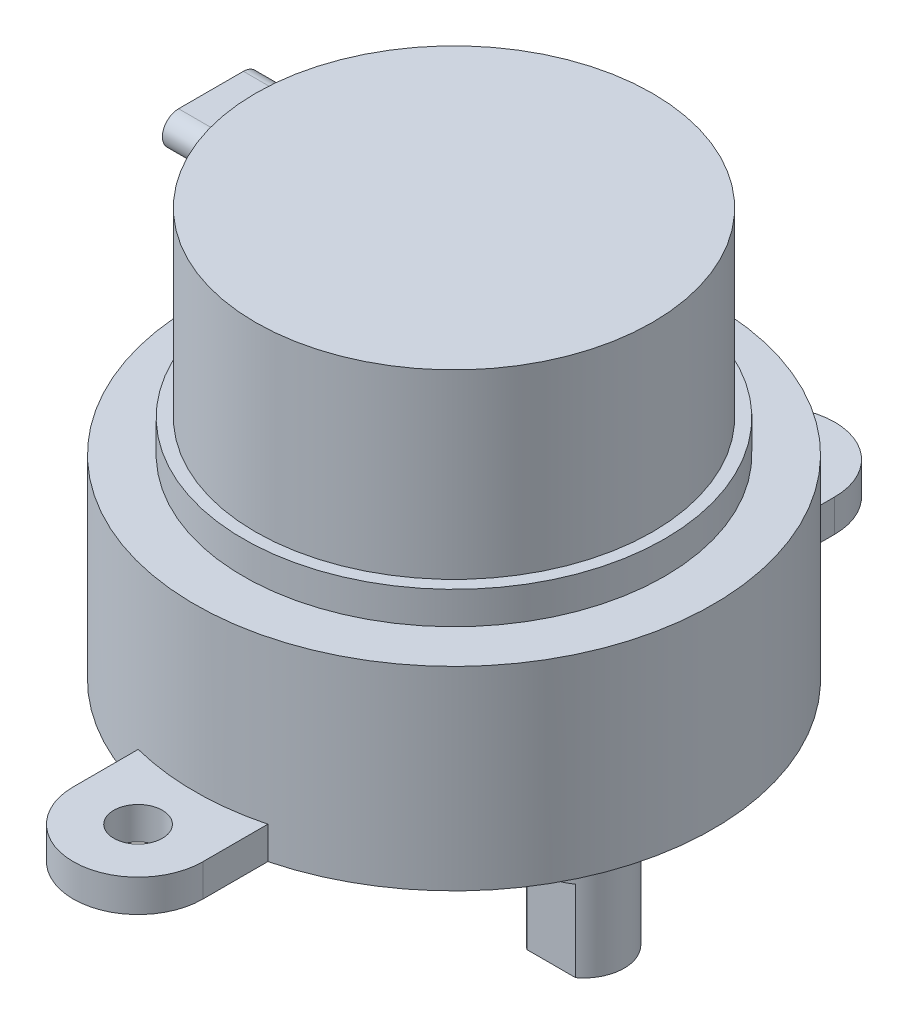
ISO-10303-21;
HEADER;
FILE_DESCRIPTION(('STEP AP214'),'2;1');
FILE_NAME('part.step','',(''),(''),'','','');
FILE_SCHEMA(('AUTOMOTIVE_DESIGN { 1 0 10303 214 1 1 1 1 }'));
ENDSEC;
DATA;
#1=APPLICATION_CONTEXT('core data for automotive mechanical design processes');
#2=APPLICATION_PROTOCOL_DEFINITION('international standard','automotive_design',2000,#1);
#3=PRODUCT_CONTEXT('',#1,'mechanical');
#4=PRODUCT('Part','Part','',(#3));
#5=PRODUCT_RELATED_PRODUCT_CATEGORY('part','',(#4));
#6=PRODUCT_DEFINITION_FORMATION('','',#4);
#7=PRODUCT_DEFINITION_CONTEXT('part definition',#1,'design');
#8=PRODUCT_DEFINITION('design','',#6,#7);
#9=PRODUCT_DEFINITION_SHAPE('','',#8);
#10=(LENGTH_UNIT() NAMED_UNIT(*) SI_UNIT(.MILLI.,.METRE.));
#11=(NAMED_UNIT(*) PLANE_ANGLE_UNIT() SI_UNIT($,.RADIAN.));
#12=(NAMED_UNIT(*) SI_UNIT($,.STERADIAN.) SOLID_ANGLE_UNIT());
#13=UNCERTAINTY_MEASURE_WITH_UNIT(LENGTH_MEASURE(1.E-05),#10,'distance_accuracy_value','');
#14=(GEOMETRIC_REPRESENTATION_CONTEXT(3) GLOBAL_UNCERTAINTY_ASSIGNED_CONTEXT((#13)) GLOBAL_UNIT_ASSIGNED_CONTEXT((#10,
#11,#12)) REPRESENTATION_CONTEXT('',''));
#15=CARTESIAN_POINT('',(0.,0.,0.));
#16=DIRECTION('',(0.,0.,1.));
#17=DIRECTION('',(1.,0.,0.));
#18=AXIS2_PLACEMENT_3D('',#15,#16,#17);
#19=CARTESIAN_POINT('',(0.,0.,0.));
#20=DIRECTION('',(0.,-1.,0.));
#21=DIRECTION('',(1.,0.,0.));
#22=AXIS2_PLACEMENT_3D('',#19,#20,#21);
#23=PLANE('',#22);
#24=CARTESIAN_POINT('',(8.,0.,0.));
#25=DIRECTION('',(0.,-1.,0.));
#26=DIRECTION('',(1.,0.,0.));
#27=AXIS2_PLACEMENT_3D('',#24,#25,#26);
#28=CIRCLE('',#27,4.5);
#29=CARTESIAN_POINT('',(12.5,0.,0.));
#30=VERTEX_POINT('',#29);
#31=EDGE_CURVE('E331',#30,#30,#28,.T.);
#32=ORIENTED_EDGE('',*,*,#31,.F.);
#33=EDGE_LOOP('',(#32));
#34=FACE_BOUND('',#33,.T.);
#35=CARTESIAN_POINT('',(0.,0.,0.));
#36=DIRECTION('',(0.,1.,0.));
#37=DIRECTION('',(-1.,0.,0.));
#38=AXIS2_PLACEMENT_3D('',#35,#36,#37);
#39=CIRCLE('',#38,16.);
#40=CARTESIAN_POINT('',(-4.,0.,-15.4919333848297));
#41=VERTEX_POINT('',#40);
#42=CARTESIAN_POINT('',(-4.00000000000001,0.,15.4919333848297));
#43=VERTEX_POINT('',#42);
#44=EDGE_CURVE('E327',#41,#43,#39,.T.);
#45=ORIENTED_EDGE('',*,*,#44,.F.);
#46=DIRECTION('',(0.,0.,-1.));
#47=VECTOR('',#46,1.);
#48=CARTESIAN_POINT('',(-4.00000000000001,0.,19.5));
#49=LINE('',#48,#47);
#50=CARTESIAN_POINT('',(-4.,0.,-19.5));
#51=VERTEX_POINT('',#50);
#52=EDGE_CURVE('E240',#41,#51,#49,.T.);
#53=ORIENTED_EDGE('',*,*,#52,.T.);
#54=CARTESIAN_POINT('',(0.,0.,-19.5));
#55=DIRECTION('',(0.,-1.,0.));
#56=DIRECTION('',(1.,0.,0.));
#57=AXIS2_PLACEMENT_3D('',#54,#55,#56);
#58=CIRCLE('',#57,4.);
#59=CARTESIAN_POINT('',(4.00000000000001,0.,-19.5));
#60=VERTEX_POINT('',#59);
#61=EDGE_CURVE('E245',#51,#60,#58,.T.);
#62=ORIENTED_EDGE('',*,*,#61,.T.);
#63=DIRECTION('',(0.,0.,1.));
#64=VECTOR('',#63,1.);
#65=CARTESIAN_POINT('',(3.99999999999999,0.,19.5));
#66=LINE('',#65,#64);
#67=CARTESIAN_POINT('',(4.,0.,-15.4919333848297));
#68=VERTEX_POINT('',#67);
#69=EDGE_CURVE('E222',#60,#68,#66,.T.);
#70=ORIENTED_EDGE('',*,*,#69,.T.);
#71=CARTESIAN_POINT('',(3.99999999999999,0.,15.4919333848297));
#72=VERTEX_POINT('',#71);
#73=EDGE_CURVE('E330',#72,#68,#39,.T.);
#74=ORIENTED_EDGE('',*,*,#73,.F.);
#75=CARTESIAN_POINT('',(3.99999999999999,0.,19.5));
#76=VERTEX_POINT('',#75);
#77=EDGE_CURVE('E249',#72,#76,#66,.T.);
#78=ORIENTED_EDGE('',*,*,#77,.T.);
#79=CARTESIAN_POINT('',(0.,0.,19.5));
#80=DIRECTION('',(0.,-1.,0.));
#81=DIRECTION('',(1.,0.,0.));
#82=AXIS2_PLACEMENT_3D('',#79,#80,#81);
#83=CIRCLE('',#82,4.);
#84=CARTESIAN_POINT('',(-4.00000000000001,0.,19.5));
#85=VERTEX_POINT('',#84);
#86=EDGE_CURVE('E213',#76,#85,#83,.T.);
#87=ORIENTED_EDGE('',*,*,#86,.T.);
#88=EDGE_CURVE('E241',#85,#43,#49,.T.);
#89=ORIENTED_EDGE('',*,*,#88,.T.);
#90=EDGE_LOOP('',(#45,#53,#62,#70,#74,#78,#87,#89));
#91=FACE_BOUND('',#90,.T.);
#92=CARTESIAN_POINT('',(0.,0.,19.5));
#93=DIRECTION('',(0.,-1.,0.));
#94=DIRECTION('',(1.,0.,0.));
#95=AXIS2_PLACEMENT_3D('',#92,#93,#94);
#96=CIRCLE('',#95,1.5);
#97=CARTESIAN_POINT('',(1.49999999999999,0.,19.5));
#98=VERTEX_POINT('',#97);
#99=EDGE_CURVE('E205',#98,#98,#96,.T.);
#100=ORIENTED_EDGE('',*,*,#99,.F.);
#101=EDGE_LOOP('',(#100));
#102=FACE_BOUND('',#101,.T.);
#103=CARTESIAN_POINT('',(0.,0.,-19.5));
#104=DIRECTION('',(0.,-1.,0.));
#105=DIRECTION('',(1.,0.,0.));
#106=AXIS2_PLACEMENT_3D('',#103,#104,#105);
#107=CIRCLE('',#106,1.5);
#108=CARTESIAN_POINT('',(1.50000000000001,0.,-19.5));
#109=VERTEX_POINT('',#108);
#110=EDGE_CURVE('E194',#109,#109,#107,.T.);
#111=ORIENTED_EDGE('',*,*,#110,.F.);
#112=EDGE_LOOP('',(#111));
#113=FACE_BOUND('',#112,.T.);
#114=ADVANCED_FACE('F41',(#34,#91,#102,#113),#23,.T.);
#115=CARTESIAN_POINT('',(0.,25.2,0.));
#116=DIRECTION('',(0.,1.,0.));
#117=DIRECTION('',(-1.,0.,0.));
#118=AXIS2_PLACEMENT_3D('',#115,#116,#117);
#119=CYLINDRICAL_SURFACE('',#118,16.);
#120=DIRECTION('',(0.,1.,0.));
#121=VECTOR('',#120,1.);
#122=CARTESIAN_POINT('',(4.00000000000001,25.2,-15.4919333848297));
#123=LINE('',#122,#121);
#124=CARTESIAN_POINT('',(4.,2.,-15.4919333848297));
#125=VERTEX_POINT('',#124);
#126=EDGE_CURVE('E373',#125,#68,#123,.F.);
#127=ORIENTED_EDGE('',*,*,#126,.F.);
#128=CARTESIAN_POINT('',(0.,2.,0.));
#129=DIRECTION('',(0.,-1.,0.));
#130=DIRECTION('',(1.,0.,0.));
#131=AXIS2_PLACEMENT_3D('',#128,#129,#130);
#132=CIRCLE('',#131,16.);
#133=CARTESIAN_POINT('',(-4.,2.,-15.4919333848297));
#134=VERTEX_POINT('',#133);
#135=EDGE_CURVE('E361',#125,#134,#132,.F.);
#136=ORIENTED_EDGE('',*,*,#135,.T.);
#137=DIRECTION('',(0.,1.,0.));
#138=VECTOR('',#137,1.);
#139=CARTESIAN_POINT('',(-3.99999999999999,25.2,-15.4919333848297));
#140=LINE('',#139,#138);
#141=EDGE_CURVE('E369',#41,#134,#140,.T.);
#142=ORIENTED_EDGE('',*,*,#141,.F.);
#143=ORIENTED_EDGE('',*,*,#44,.T.);
#144=DIRECTION('',(0.,1.,0.));
#145=VECTOR('',#144,1.);
#146=CARTESIAN_POINT('',(-4.00000000000001,25.2,15.4919333848297));
#147=LINE('',#146,#145);
#148=CARTESIAN_POINT('',(-4.00000000000001,2.,15.4919333848297));
#149=VERTEX_POINT('',#148);
#150=EDGE_CURVE('E360',#149,#43,#147,.F.);
#151=ORIENTED_EDGE('',*,*,#150,.F.);
#152=CARTESIAN_POINT('',(3.99999999999999,2.,15.4919333848297));
#153=VERTEX_POINT('',#152);
#154=EDGE_CURVE('E357',#149,#153,#132,.F.);
#155=ORIENTED_EDGE('',*,*,#154,.T.);
#156=DIRECTION('',(0.,1.,0.));
#157=VECTOR('',#156,1.);
#158=CARTESIAN_POINT('',(4.,25.2,15.4919333848297));
#159=LINE('',#158,#157);
#160=EDGE_CURVE('E365',#72,#153,#159,.T.);
#161=ORIENTED_EDGE('',*,*,#160,.F.);
#162=ORIENTED_EDGE('',*,*,#73,.T.);
#163=EDGE_LOOP('',(#127,#136,#142,#143,#151,#155,#161,#162));
#164=FACE_BOUND('',#163,.T.);
#165=CARTESIAN_POINT('',(0.,12.,0.));
#166=DIRECTION('',(0.,1.,0.));
#167=DIRECTION('',(-1.,0.,0.));
#168=AXIS2_PLACEMENT_3D('',#165,#166,#167);
#169=CIRCLE('',#168,16.);
#170=CARTESIAN_POINT('',(-16.,12.,0.));
#171=VERTEX_POINT('',#170);
#172=EDGE_CURVE('E323',#171,#171,#169,.T.);
#173=ORIENTED_EDGE('',*,*,#172,.F.);
#174=EDGE_LOOP('',(#173));
#175=FACE_BOUND('',#174,.T.);
#176=ADVANCED_FACE('F486',(#164,#175),#119,.T.);
#177=CARTESIAN_POINT('',(-16.,12.,0.));
#178=DIRECTION('',(0.,1.,0.));
#179=DIRECTION('',(-1.,0.,0.));
#180=AXIS2_PLACEMENT_3D('',#177,#178,#179);
#181=PLANE('',#180);
#182=ORIENTED_EDGE('',*,*,#172,.T.);
#183=EDGE_LOOP('',(#182));
#184=FACE_BOUND('',#183,.T.);
#185=CARTESIAN_POINT('',(0.,12.,0.));
#186=DIRECTION('',(0.,1.,0.));
#187=DIRECTION('',(-1.,0.,0.));
#188=AXIS2_PLACEMENT_3D('',#185,#186,#187);
#189=CIRCLE('',#188,13.);
#190=CARTESIAN_POINT('',(-13.,12.,0.));
#191=VERTEX_POINT('',#190);
#192=EDGE_CURVE('E319',#191,#191,#189,.T.);
#193=ORIENTED_EDGE('',*,*,#192,.F.);
#194=EDGE_LOOP('',(#193));
#195=FACE_BOUND('',#194,.T.);
#196=ADVANCED_FACE('F491',(#184,#195),#181,.T.);
#197=CARTESIAN_POINT('',(0.,25.2,0.));
#198=DIRECTION('',(0.,1.,0.));
#199=DIRECTION('',(-1.,0.,0.));
#200=AXIS2_PLACEMENT_3D('',#197,#198,#199);
#201=CYLINDRICAL_SURFACE('',#200,13.);
#202=ORIENTED_EDGE('',*,*,#192,.T.);
#203=EDGE_LOOP('',(#202));
#204=FACE_BOUND('',#203,.T.);
#205=CARTESIAN_POINT('',(0.,14.,0.));
#206=DIRECTION('',(0.,1.,0.));
#207=DIRECTION('',(-1.,0.,0.));
#208=AXIS2_PLACEMENT_3D('',#205,#206,#207);
#209=CIRCLE('',#208,13.);
#210=CARTESIAN_POINT('',(-13.,14.,0.));
#211=VERTEX_POINT('',#210);
#212=EDGE_CURVE('E315',#211,#211,#209,.T.);
#213=ORIENTED_EDGE('',*,*,#212,.F.);
#214=EDGE_LOOP('',(#213));
#215=FACE_BOUND('',#214,.T.);
#216=ADVANCED_FACE('F692',(#204,#215),#201,.T.);
#217=CARTESIAN_POINT('',(-13.,14.,0.));
#218=DIRECTION('',(0.,1.,0.));
#219=DIRECTION('',(-1.,0.,0.));
#220=AXIS2_PLACEMENT_3D('',#217,#218,#219);
#221=PLANE('',#220);
#222=ORIENTED_EDGE('',*,*,#212,.T.);
#223=EDGE_LOOP('',(#222));
#224=FACE_BOUND('',#223,.T.);
#225=CARTESIAN_POINT('',(0.,14.,0.));
#226=DIRECTION('',(0.,1.,0.));
#227=DIRECTION('',(-1.,0.,0.));
#228=AXIS2_PLACEMENT_3D('',#225,#226,#227);
#229=CIRCLE('',#228,12.25);
#230=CARTESIAN_POINT('',(-12.25,14.,0.));
#231=VERTEX_POINT('',#230);
#232=EDGE_CURVE('E311',#231,#231,#229,.T.);
#233=ORIENTED_EDGE('',*,*,#232,.F.);
#234=EDGE_LOOP('',(#233));
#235=FACE_BOUND('',#234,.T.);
#236=ADVANCED_FACE('F484',(#224,#235),#221,.T.);
#237=CARTESIAN_POINT('',(0.,25.2,0.));
#238=DIRECTION('',(0.,1.,0.));
#239=DIRECTION('',(-1.,0.,0.));
#240=AXIS2_PLACEMENT_3D('',#237,#238,#239);
#241=CYLINDRICAL_SURFACE('',#240,12.25);
#242=CARTESIAN_POINT('',(-12.2091154470748,23.,0.999999999999999));
#243=CARTESIAN_POINT('',(-12.209115587491,22.9440075020063,1.00000243226013));
#244=CARTESIAN_POINT('',(-12.2087318158678,22.8879768047936,1.00471850011197));
#245=CARTESIAN_POINT('',(-12.2071744792049,22.7774616326753,1.02346290472915));
#246=CARTESIAN_POINT('',(-12.2060000189499,22.7229789834153,1.03750179652373));
#247=CARTESIAN_POINT('',(-12.2028000324957,22.6171734324166,1.07448306381232));
#248=CARTESIAN_POINT('',(-12.2007748966666,22.5658490937181,1.0974213550569));
#249=CARTESIAN_POINT('',(-12.1957869140144,22.467806990783,1.15152769281933));
#250=CARTESIAN_POINT('',(-12.1928242920917,22.4210881252284,1.18269376521911));
#251=CARTESIAN_POINT('',(-12.1858653078248,22.3335414514808,1.2523613446529));
#252=CARTESIAN_POINT('',(-12.181868531928,22.2927160102354,1.29086578463482));
#253=CARTESIAN_POINT('',(-12.1727632018265,22.2181168532332,1.37407569998462));
#254=CARTESIAN_POINT('',(-12.1676546070659,22.1843433947995,1.41878140153428));
#255=CARTESIAN_POINT('',(-12.1562725352145,22.124693637607,1.51320911239394));
#256=CARTESIAN_POINT('',(-12.1499961245714,22.0988376701493,1.56294360712069));
#257=CARTESIAN_POINT('',(-12.1363091850117,22.0558156706134,1.66589123075606));
#258=CARTESIAN_POINT('',(-12.1288986220631,22.038649899364,1.71910446402186));
#259=CARTESIAN_POINT('',(-12.1129794165599,22.0133231233163,1.82791531472614));
#260=CARTESIAN_POINT('',(-12.1044627246384,22.0052327889035,1.88352819018249));
#261=CARTESIAN_POINT('',(-12.0865601401689,21.9984482465952,1.9951845801136));
#262=CARTESIAN_POINT('',(-12.0771741840528,21.9997547264122,2.05122812580744));
#263=CARTESIAN_POINT('',(-12.057672154433,22.011744941181,2.16293759982548));
#264=CARTESIAN_POINT('',(-12.0475481371498,22.0225511004278,2.21858900194441));
#265=CARTESIAN_POINT('',(-12.0270341234675,22.0533700585563,2.32723204352503));
#266=CARTESIAN_POINT('',(-12.0166441038583,22.0733836634345,2.38022344968689));
#267=CARTESIAN_POINT('',(-11.9959006123057,22.1223376223262,2.48266629100746));
#268=CARTESIAN_POINT('',(-11.9855488121874,22.1513741517197,2.53207215103369));
#269=CARTESIAN_POINT('',(-11.9654753398351,22.2175219583013,2.62529559523094));
#270=CARTESIAN_POINT('',(-11.9557536770177,22.2546333561211,2.66911309590108));
#271=CARTESIAN_POINT('',(-11.9374668239794,22.3358120719388,2.74974417146139));
#272=CARTESIAN_POINT('',(-11.9288979719094,22.3798563517174,2.78658008315234));
#273=CARTESIAN_POINT('',(-11.9133593985442,22.4737878196676,2.85228181295576));
#274=CARTESIAN_POINT('',(-11.9063894708402,22.5236742524047,2.88114865991129));
#275=CARTESIAN_POINT('',(-11.8946028791258,22.6267225971041,2.92942474687442));
#276=CARTESIAN_POINT('',(-11.889742457029,22.6797890140922,2.94902701739822));
#277=CARTESIAN_POINT('',(-11.8822609358124,22.7886116415661,2.97902955273218));
#278=CARTESIAN_POINT('',(-11.8796394313422,22.844367363228,2.98943148325331));
#279=CARTESIAN_POINT('',(-11.8768431625035,22.9554078836471,3.00052133737034));
#280=CARTESIAN_POINT('',(-11.8766057500283,23.0106663823248,3.00145798955113));
#281=CARTESIAN_POINT('',(-11.8784291995955,23.1205437797099,2.99423334265516));
#282=CARTESIAN_POINT('',(-11.8804899024283,23.1751627224596,2.98607267382568));
#283=CARTESIAN_POINT('',(-11.8867528032149,23.2817226569265,2.96104210787612));
#284=CARTESIAN_POINT('',(-11.8909359743826,23.3336830022958,2.94424957355515));
#285=CARTESIAN_POINT('',(-11.9011865477639,23.4340289689592,2.90253637215798));
#286=CARTESIAN_POINT('',(-11.9072540809397,23.4824143415046,2.87761514013442));
#287=CARTESIAN_POINT('',(-11.9210463883677,23.5750914652343,2.81993669034967));
#288=CARTESIAN_POINT('',(-11.9287960640583,23.619305567428,2.78706077072699));
#289=CARTESIAN_POINT('',(-11.9454833063207,23.7016315325735,2.71464665022692));
#290=CARTESIAN_POINT('',(-11.9544210406149,23.7397425322516,2.67510750846818));
#291=CARTESIAN_POINT('',(-11.9733039729605,23.8098632592369,2.58929909069321));
#292=CARTESIAN_POINT('',(-11.9832698726956,23.841680223933,2.54287678697536));
#293=CARTESIAN_POINT('',(-12.0035372855166,23.8970762037628,2.44541774671216));
#294=CARTESIAN_POINT('',(-12.0138388351497,23.9206543185091,2.39438050658767));
#295=CARTESIAN_POINT('',(-12.0345320695704,23.9592890928548,2.28812497868322));
#296=CARTESIAN_POINT('',(-12.0449221039685,23.9741869099997,2.23284851723267));
#297=CARTESIAN_POINT('',(-12.0652118174705,23.9943559880011,2.12047691172026));
#298=CARTESIAN_POINT('',(-12.0751114920583,23.9996271602116,2.06338175091602));
#299=CARTESIAN_POINT('',(-12.0940936571131,24.0003342696606,1.94903927138421));
#300=CARTESIAN_POINT('',(-12.1031768118932,23.9957782790259,1.89179211608659));
#301=CARTESIAN_POINT('',(-12.120303064558,23.9769027291646,1.77876951331334));
#302=CARTESIAN_POINT('',(-12.1283462306786,23.9625838108906,1.72299396947361));
#303=CARTESIAN_POINT('',(-12.1431599901326,23.9247693479168,1.6152669800622));
#304=CARTESIAN_POINT('',(-12.149945309659,23.9013914231106,1.5632762765458));
#305=CARTESIAN_POINT('',(-12.1623175142415,23.8460752483735,1.46391324231902));
#306=CARTESIAN_POINT('',(-12.1679045237137,23.8141378879127,1.41654043242847));
#307=CARTESIAN_POINT('',(-12.1778416935622,23.7430390609246,1.32838967888944));
#308=CARTESIAN_POINT('',(-12.1822061897337,23.7039710482471,1.28753794440732));
#309=CARTESIAN_POINT('',(-12.1898599510351,23.6194468196314,1.2129404162689));
#310=CARTESIAN_POINT('',(-12.1931490014227,23.5739893304468,1.17919604227024));
#311=CARTESIAN_POINT('',(-12.1987288440366,23.4782751804905,1.1199984180146));
#312=CARTESIAN_POINT('',(-12.2010252243871,23.4280473791085,1.09449896426932));
#313=CARTESIAN_POINT('',(-12.2047378021864,23.3240385566134,1.05229657935582));
#314=CARTESIAN_POINT('',(-12.2061550069589,23.2702616803727,1.03558358438438));
#315=CARTESIAN_POINT('',(-12.2078224233675,23.1801406722458,1.01569137380415));
#316=CARTESIAN_POINT('',(-12.208308220153,23.1443730727883,1.00981489923914));
#317=CARTESIAN_POINT('',(-12.2089546865458,23.0724089746542,1.00196842647542));
#318=CARTESIAN_POINT('',(-12.2091153562623,23.0362124761215,0.999998426964947));
#319=CARTESIAN_POINT('',(-12.2091154470748,23.,0.999999999999999));
#320=B_SPLINE_CURVE_WITH_KNOTS('',3,(#242,#243,#244,#245,#246,#247,#248,#249,#250,#251,#252,
#253,#254,#255,#256,#257,#258,#259,#260,#261,#262,#263,#264,#265,#266,#267,#268,#269,#270,#271,
#272,#273,#274,#275,#276,#277,#278,#279,#280,#281,#282,#283,#284,#285,#286,#287,#288,#289,#290,
#291,#292,#293,#294,#295,#296,#297,#298,#299,#300,#301,#302,#303,#304,#305,#306,#307,#308,#309,
#310,#311,#312,#313,#314,#315,#316,#317,#318,#319),.UNSPECIFIED.,.T.,.F.,(4,2,2,2,2,2,2,2,2,2,2,
2,2,2,2,2,2,2,2,2,2,2,2,2,2,2,2,2,2,2,2,2,2,2,2,2,2,2,4),(0.,0.167845559112244,
0.335881472789682,0.503840359888297,0.671758984637381,0.83974486321635,1.00773687044184,
1.17615671458339,1.34458161340002,1.51430912410867,1.68404905657255,1.85600906597338,
2.02798413118439,2.20185908534632,2.37573663723155,2.5490481330615,2.72233724310158,
2.89183652927815,3.06130512151865,3.22630846046957,3.39130036897401,3.55483867829044,
3.71838835599968,3.88454799631469,4.05073111891755,4.221406182034,4.39209989163948,
4.56582629713991,4.73955430237489,4.91313966008963,5.0867136227318,5.25810562888358,
5.42947983140524,5.59875114820463,5.76805624405619,5.93639543492737,6.10454139165102,
6.2130935291736,6.32164563024508),.UNSPECIFIED.);
#321=CARTESIAN_POINT('',(-12.0856319652718,22.,2.));
#322=VERTEX_POINT('',#321);
#323=CARTESIAN_POINT('',(-12.0856319652718,24.,2.));
#324=VERTEX_POINT('',#323);
#325=EDGE_CURVE('E11',#322,#324,#320,.T.);
#326=ORIENTED_EDGE('',*,*,#325,.F.);
#327=CARTESIAN_POINT('',(0.,22.,0.));
#328=DIRECTION('',(0.,-1.,0.));
#329=DIRECTION('',(0.,0.,-1.));
#330=AXIS2_PLACEMENT_3D('',#327,#328,#329);
#331=CIRCLE('',#330,12.25);
#332=CARTESIAN_POINT('',(-12.0856319652718,22.,-2.));
#333=VERTEX_POINT('',#332);
#334=EDGE_CURVE('E164',#333,#322,#331,.F.);
#335=ORIENTED_EDGE('',*,*,#334,.F.);
#336=CARTESIAN_POINT('',(-11.8769735202197,23.,-3.));
#337=CARTESIAN_POINT('',(-11.8769745202216,22.9449767365111,-2.99999740240367));
#338=CARTESIAN_POINT('',(-11.8781279085519,22.8899151560983,-2.99544119636934));
#339=CARTESIAN_POINT('',(-11.8826738419004,22.7813398629496,-2.9773554859566));
#340=CARTESIAN_POINT('',(-11.8860689674695,22.7278280083565,-2.96381564007317));
#341=CARTESIAN_POINT('',(-11.8948861130197,22.6239654140232,-2.92822776316575));
#342=CARTESIAN_POINT('',(-11.9003056171563,22.5736108408348,-2.90619029167444));
#343=CARTESIAN_POINT('',(-11.9128570696673,22.4773562810701,-2.85430299033897));
#344=CARTESIAN_POINT('',(-11.9199887688638,22.4314556476696,-2.82445429721541));
#345=CARTESIAN_POINT('',(-11.9357047123719,22.3445834712503,-2.75729173003749));
#346=CARTESIAN_POINT('',(-11.9443101028236,22.3037011432392,-2.71986748358673));
#347=CARTESIAN_POINT('',(-11.9624549271495,22.2287495356026,-2.63891836794452));
#348=CARTESIAN_POINT('',(-11.9719945122884,22.1946813620498,-2.59539251028732));
#349=CARTESIAN_POINT('',(-11.9918220904954,22.1334086888724,-2.50220448646822));
#350=CARTESIAN_POINT('',(-12.0021231374588,22.1064071933035,-2.45241152054478));
#351=CARTESIAN_POINT('',(-12.0227901978425,22.0611786055682,-2.34899860891498));
#352=CARTESIAN_POINT('',(-12.0331562166846,22.0429522558484,-2.29537833982914));
#353=CARTESIAN_POINT('',(-12.0536723549528,22.0156202703054,-2.18510040200996));
#354=CARTESIAN_POINT('',(-12.0638183092715,22.0066283802749,-2.12841370121095));
#355=CARTESIAN_POINT('',(-12.0834096200956,21.9984639319419,-2.01421630003919));
#356=CARTESIAN_POINT('',(-12.092854994783,21.9992911187193,-1.95670562109707));
#357=CARTESIAN_POINT('',(-12.1107263577517,22.0107783345157,-1.84285353920486));
#358=CARTESIAN_POINT('',(-12.1191579008928,22.0213817360039,-1.78650731120154));
#359=CARTESIAN_POINT('',(-12.1348914827059,22.0521104399909,-1.67630780055416));
#360=CARTESIAN_POINT('',(-12.1421936037808,22.0722350473851,-1.62245433623854));
#361=CARTESIAN_POINT('',(-12.1554950329933,22.1211434658726,-1.51957165199824));
#362=CARTESIAN_POINT('',(-12.1615107134168,22.1498057509411,-1.47048676900021));
#363=CARTESIAN_POINT('',(-12.1723609679393,22.2150988348091,-1.37779148232797));
#364=CARTESIAN_POINT('',(-12.1771956110967,22.2517291674597,-1.33418075863823));
#365=CARTESIAN_POINT('',(-12.1856950210884,22.3314973752636,-1.25417009335182));
#366=CARTESIAN_POINT('',(-12.1893715130929,22.374563056454,-1.21769939695549));
#367=CARTESIAN_POINT('',(-12.1957107269359,22.4662586676798,-1.15248290625371));
#368=CARTESIAN_POINT('',(-12.1983734747552,22.5148884550727,-1.12373691397934));
#369=CARTESIAN_POINT('',(-12.2027715660058,22.6160968942542,-1.07492647196196));
#370=CARTESIAN_POINT('',(-12.2045109629122,22.6686571111571,-1.05482415201795));
#371=CARTESIAN_POINT('',(-12.2071610189559,22.7764209715949,-1.02370202152516));
#372=CARTESIAN_POINT('',(-12.2080716835558,22.8316245977032,-1.01268215110941));
#373=CARTESIAN_POINT('',(-12.2091129265999,22.9430502233439,-1.00005124206456));
#374=CARTESIAN_POINT('',(-12.2092442664248,22.9992711750789,-0.998431020250286));
#375=CARTESIAN_POINT('',(-12.2087364068883,23.1111878910055,-1.00462161070868));
#376=CARTESIAN_POINT('',(-12.2080972089163,23.1668836561437,-1.01243240597848));
#377=CARTESIAN_POINT('',(-12.2060128490654,23.2761646902764,-1.03725783330308));
#378=CARTESIAN_POINT('',(-12.2045677466235,23.3297501146006,-1.05427178660443));
#379=CARTESIAN_POINT('',(-12.2008003524991,23.433294018192,-1.09700875079146));
#380=CARTESIAN_POINT('',(-12.1984780652998,23.4832525159953,-1.12273171716462));
#381=CARTESIAN_POINT('',(-12.1928638277103,23.5781358535849,-1.1821415238623));
#382=CARTESIAN_POINT('',(-12.1895717233372,23.6230598924597,-1.215829628685));
#383=CARTESIAN_POINT('',(-12.1819261317655,23.7066008030544,-1.29018160468892));
#384=CARTESIAN_POINT('',(-12.1775726487326,23.7452176995273,-1.33084544849198));
#385=CARTESIAN_POINT('',(-12.1677288705662,23.8151275226186,-1.41802594306126));
#386=CARTESIAN_POINT('',(-12.1622368595946,23.8464092412123,-1.46455138565034));
#387=CARTESIAN_POINT('',(-12.1500992926244,23.9007294165211,-1.56204915335376));
#388=CARTESIAN_POINT('',(-12.1434537167969,23.9237677315175,-1.61302155490052));
#389=CARTESIAN_POINT('',(-12.129013184402,23.9611191185522,-1.71824706125121));
#390=CARTESIAN_POINT('',(-12.121211877716,23.9753815862608,-1.7725172465829));
#391=CARTESIAN_POINT('',(-12.104614112415,23.99464535671,-1.88252790990653));
#392=CARTESIAN_POINT('',(-12.0958175904538,23.9996460695805,-1.9382684813163));
#393=CARTESIAN_POINT('',(-12.0773310495549,24.0003215136665,-2.05032591390413));
#394=CARTESIAN_POINT('',(-12.0676317954372,23.9958866464902,-2.10664190275135));
#395=CARTESIAN_POINT('',(-12.0477273325276,23.9776478063103,-2.21764464299489));
#396=CARTESIAN_POINT('',(-12.0375220783743,23.9638429919093,-2.27233124761629));
#397=CARTESIAN_POINT('',(-12.0168421376933,23.9270279024094,-2.37928811523291));
#398=CARTESIAN_POINT('',(-12.0063656730355,23.9038997947126,-2.43151750896229));
#399=CARTESIAN_POINT('',(-11.9857184052331,23.8490735975655,-2.53133465309125));
#400=CARTESIAN_POINT('',(-11.975547607075,23.8173753683867,-2.57892232779441));
#401=CARTESIAN_POINT('',(-11.9559674429023,23.7461513734658,-2.6682280841015));
#402=CARTESIAN_POINT('',(-11.9465601702151,23.7066050487658,-2.70993024625729));
#403=CARTESIAN_POINT('',(-11.9290320391361,23.6207841352005,-2.78607709127941));
#404=CARTESIAN_POINT('',(-11.9209113865454,23.5745084722115,-2.82052061338216));
#405=CARTESIAN_POINT('',(-11.9065438655515,23.4773036584895,-2.88056492756041));
#406=CARTESIAN_POINT('',(-11.9002694663161,23.4264594047259,-2.90629660748486));
#407=CARTESIAN_POINT('',(-11.8898141274244,23.3209966987596,-2.9487800467752));
#408=CARTESIAN_POINT('',(-11.8856302878085,23.2663835950285,-2.96554424784139));
#409=CARTESIAN_POINT('',(-11.8807547191482,23.17615443928,-2.98499950402554));
#410=CARTESIAN_POINT('',(-11.8793404864948,23.1411807182262,-2.99061610416011));
#411=CARTESIAN_POINT('',(-11.8774495747536,23.0708099495778,-2.99811715014307));
#412=CARTESIAN_POINT('',(-11.8769728766196,23.0354129105977,-3.00000167181008));
#413=CARTESIAN_POINT('',(-11.8769735202197,23.,-3.));
#414=B_SPLINE_CURVE_WITH_KNOTS('',3,(#336,#337,#338,#339,#340,#341,#342,#343,#344,#345,#346,
#347,#348,#349,#350,#351,#352,#353,#354,#355,#356,#357,#358,#359,#360,#361,#362,#363,#364,#365,
#366,#367,#368,#369,#370,#371,#372,#373,#374,#375,#376,#377,#378,#379,#380,#381,#382,#383,#384,
#385,#386,#387,#388,#389,#390,#391,#392,#393,#394,#395,#396,#397,#398,#399,#400,#401,#402,#403,
#404,#405,#406,#407,#408,#409,#410,#411,#412,#413),.UNSPECIFIED.,.T.,.F.,(4,2,2,2,2,2,2,2,2,2,2,
2,2,2,2,2,2,2,2,2,2,2,2,2,2,2,2,2,2,2,2,2,2,2,2,2,2,2,4),(0.,0.164938272386896,
0.330066743428775,0.494990676241961,0.659890621990127,0.827392800531339,0.994922145981992,
1.166836692973,1.33876578273603,1.51278809834317,1.68680589604098,1.85982200689491,
2.03282548849119,2.20347539727006,2.37411532532426,2.54296760851651,2.71181556394487,
2.87991602174787,3.04801537150787,3.2159504653663,3.38388525646048,3.55180766367724,
3.71972921264091,3.8876774377552,4.05562500372664,4.22382754237806,4.39203297259211,
4.56119945556356,4.73037671217498,4.90152975699118,5.07269817294507,5.24610134940969,
5.4195073532336,5.59337375656198,5.76726794262914,5.93841973093633,6.10933343906472,
6.21548968259648,6.32164376950116),.UNSPECIFIED.);
#415=CARTESIAN_POINT('',(-12.0856319652718,24.,-2.));
#416=VERTEX_POINT('',#415);
#417=EDGE_CURVE('E64',#416,#333,#414,.T.);
#418=ORIENTED_EDGE('',*,*,#417,.F.);
#419=CARTESIAN_POINT('',(0.,24.,0.));
#420=DIRECTION('',(0.,1.,0.));
#421=DIRECTION('',(0.,0.,1.));
#422=AXIS2_PLACEMENT_3D('',#419,#420,#421);
#423=CIRCLE('',#422,12.25);
#424=EDGE_CURVE('E54',#324,#416,#423,.F.);
#425=ORIENTED_EDGE('',*,*,#424,.F.);
#426=EDGE_LOOP('',(#326,#335,#418,#425));
#427=FACE_BOUND('',#426,.T.);
#428=ORIENTED_EDGE('',*,*,#232,.T.);
#429=EDGE_LOOP('',(#428));
#430=FACE_BOUND('',#429,.T.);
#431=CARTESIAN_POINT('',(0.,25.2,0.));
#432=DIRECTION('',(0.,1.,0.));
#433=DIRECTION('',(-1.,0.,0.));
#434=AXIS2_PLACEMENT_3D('',#431,#432,#433);
#435=CIRCLE('',#434,12.25);
#436=CARTESIAN_POINT('',(-12.25,25.2,0.));
#437=VERTEX_POINT('',#436);
#438=EDGE_CURVE('E307',#437,#437,#435,.T.);
#439=ORIENTED_EDGE('',*,*,#438,.F.);
#440=EDGE_LOOP('',(#439));
#441=FACE_BOUND('',#440,.T.);
#442=ADVANCED_FACE('F384',(#427,#430,#441),#241,.T.);
#443=CARTESIAN_POINT('',(-12.25,25.2,0.));
#444=DIRECTION('',(0.,1.,0.));
#445=DIRECTION('',(-1.,0.,0.));
#446=AXIS2_PLACEMENT_3D('',#443,#444,#445);
#447=PLANE('',#446);
#448=ORIENTED_EDGE('',*,*,#438,.T.);
#449=EDGE_LOOP('',(#448));
#450=FACE_BOUND('',#449,.T.);
#451=ADVANCED_FACE('F477',(#450),#447,.T.);
#452=CARTESIAN_POINT('',(8.,-10.2,0.));
#453=DIRECTION('',(0.,-1.,0.));
#454=DIRECTION('',(1.,0.,0.));
#455=AXIS2_PLACEMENT_3D('',#452,#453,#454);
#456=PLANE('',#455);
#457=DIRECTION('',(1.,0.,0.));
#458=VECTOR('',#457,1.);
#459=CARTESIAN_POINT('',(3.49145463069515,-10.2,2.));
#460=LINE('',#459,#458);
#461=CARTESIAN_POINT('',(6.5,-10.2,2.));
#462=VERTEX_POINT('',#461);
#463=CARTESIAN_POINT('',(9.5,-10.2,2.));
#464=VERTEX_POINT('',#463);
#465=EDGE_CURVE('E271',#462,#464,#460,.T.);
#466=ORIENTED_EDGE('',*,*,#465,.F.);
#467=CARTESIAN_POINT('',(8.,-10.2,0.));
#468=DIRECTION('',(0.,1.,0.));
#469=DIRECTION('',(-1.,0.,0.));
#470=AXIS2_PLACEMENT_3D('',#467,#468,#469);
#471=CIRCLE('',#470,2.5);
#472=CARTESIAN_POINT('',(6.5,-10.2,-2.));
#473=VERTEX_POINT('',#472);
#474=EDGE_CURVE('E302',#473,#462,#471,.T.);
#475=ORIENTED_EDGE('',*,*,#474,.F.);
#476=DIRECTION('',(-1.,0.,0.));
#477=VECTOR('',#476,1.);
#478=CARTESIAN_POINT('',(2.79316370455612,-10.2,-2.));
#479=LINE('',#478,#477);
#480=CARTESIAN_POINT('',(9.5,-10.2,-2.));
#481=VERTEX_POINT('',#480);
#482=EDGE_CURVE('E257',#481,#473,#479,.T.);
#483=ORIENTED_EDGE('',*,*,#482,.F.);
#484=EDGE_CURVE('E306',#464,#481,#471,.T.);
#485=ORIENTED_EDGE('',*,*,#484,.F.);
#486=EDGE_LOOP('',(#466,#475,#483,#485));
#487=FACE_BOUND('',#486,.T.);
#488=CARTESIAN_POINT('',(8.,-10.2,0.));
#489=DIRECTION('',(0.,-1.,0.));
#490=DIRECTION('',(0.,0.,-1.));
#491=AXIS2_PLACEMENT_3D('',#488,#489,#490);
#492=CIRCLE('',#491,1.24999999999999);
#493=CARTESIAN_POINT('',(8.,-10.2,-1.24999999999999));
#494=VERTEX_POINT('',#493);
#495=EDGE_CURVE('E270',#494,#494,#492,.T.);
#496=ORIENTED_EDGE('',*,*,#495,.F.);
#497=EDGE_LOOP('',(#496));
#498=FACE_BOUND('',#497,.T.);
#499=ADVANCED_FACE('F474',(#487,#498),#456,.T.);
#500=CARTESIAN_POINT('',(8.,0.,0.));
#501=DIRECTION('',(0.,1.,0.));
#502=DIRECTION('',(-1.,0.,0.));
#503=AXIS2_PLACEMENT_3D('',#500,#501,#502);
#504=CYLINDRICAL_SURFACE('',#503,2.5);
#505=DIRECTION('',(0.,1.,0.));
#506=VECTOR('',#505,1.);
#507=CARTESIAN_POINT('',(6.5,0.,2.));
#508=LINE('',#507,#506);
#509=CARTESIAN_POINT('',(6.5,-5.2,2.));
#510=VERTEX_POINT('',#509);
#511=EDGE_CURVE('E354',#510,#462,#508,.F.);
#512=ORIENTED_EDGE('',*,*,#511,.F.);
#513=CARTESIAN_POINT('',(8.,-5.2,0.));
#514=DIRECTION('',(0.,-1.,0.));
#515=DIRECTION('',(1.,0.,0.));
#516=AXIS2_PLACEMENT_3D('',#513,#514,#515);
#517=CIRCLE('',#516,2.5);
#518=CARTESIAN_POINT('',(9.5,-5.2,2.));
#519=VERTEX_POINT('',#518);
#520=EDGE_CURVE('E346',#510,#519,#517,.F.);
#521=ORIENTED_EDGE('',*,*,#520,.T.);
#522=DIRECTION('',(0.,1.,0.));
#523=VECTOR('',#522,1.);
#524=CARTESIAN_POINT('',(9.5,0.,2.));
#525=LINE('',#524,#523);
#526=EDGE_CURVE('E350',#464,#519,#525,.T.);
#527=ORIENTED_EDGE('',*,*,#526,.F.);
#528=ORIENTED_EDGE('',*,*,#484,.T.);
#529=DIRECTION('',(0.,1.,0.));
#530=VECTOR('',#529,1.);
#531=CARTESIAN_POINT('',(9.5,0.,-2.));
#532=LINE('',#531,#530);
#533=CARTESIAN_POINT('',(9.5,-5.2,-2.));
#534=VERTEX_POINT('',#533);
#535=EDGE_CURVE('E343',#534,#481,#532,.F.);
#536=ORIENTED_EDGE('',*,*,#535,.F.);
#537=CARTESIAN_POINT('',(8.,-5.2,0.));
#538=DIRECTION('',(0.,-1.,0.));
#539=DIRECTION('',(1.,0.,0.));
#540=AXIS2_PLACEMENT_3D('',#537,#538,#539);
#541=CIRCLE('',#540,2.5);
#542=CARTESIAN_POINT('',(6.5,-5.2,-2.));
#543=VERTEX_POINT('',#542);
#544=EDGE_CURVE('E335',#534,#543,#541,.F.);
#545=ORIENTED_EDGE('',*,*,#544,.T.);
#546=DIRECTION('',(0.,1.,0.));
#547=VECTOR('',#546,1.);
#548=CARTESIAN_POINT('',(6.5,0.,-2.));
#549=LINE('',#548,#547);
#550=EDGE_CURVE('E339',#473,#543,#549,.T.);
#551=ORIENTED_EDGE('',*,*,#550,.F.);
#552=ORIENTED_EDGE('',*,*,#474,.T.);
#553=EDGE_LOOP('',(#512,#521,#527,#528,#536,#545,#551,#552));
#554=FACE_BOUND('',#553,.T.);
#555=CARTESIAN_POINT('',(8.,-2.7,0.));
#556=DIRECTION('',(0.,1.,0.));
#557=DIRECTION('',(-1.,0.,0.));
#558=AXIS2_PLACEMENT_3D('',#555,#556,#557);
#559=CIRCLE('',#558,2.5);
#560=CARTESIAN_POINT('',(5.5,-2.7,0.));
#561=VERTEX_POINT('',#560);
#562=EDGE_CURVE('E298',#561,#561,#559,.T.);
#563=ORIENTED_EDGE('',*,*,#562,.F.);
#564=EDGE_LOOP('',(#563));
#565=FACE_BOUND('',#564,.T.);
#566=ADVANCED_FACE('F470',(#554,#565),#504,.T.);
#567=CARTESIAN_POINT('',(5.5,-2.7,0.));
#568=DIRECTION('',(0.,-1.,0.));
#569=DIRECTION('',(1.,0.,0.));
#570=AXIS2_PLACEMENT_3D('',#567,#568,#569);
#571=PLANE('',#570);
#572=ORIENTED_EDGE('',*,*,#562,.T.);
#573=EDGE_LOOP('',(#572));
#574=FACE_BOUND('',#573,.T.);
#575=CARTESIAN_POINT('',(8.,-2.7,0.));
#576=DIRECTION('',(0.,1.,0.));
#577=DIRECTION('',(-1.,0.,0.));
#578=AXIS2_PLACEMENT_3D('',#575,#576,#577);
#579=CIRCLE('',#578,4.);
#580=CARTESIAN_POINT('',(4.,-2.7,0.));
#581=VERTEX_POINT('',#580);
#582=EDGE_CURVE('E294',#581,#581,#579,.T.);
#583=ORIENTED_EDGE('',*,*,#582,.F.);
#584=EDGE_LOOP('',(#583));
#585=FACE_BOUND('',#584,.T.);
#586=ADVANCED_FACE('F466',(#574,#585),#571,.T.);
#587=CARTESIAN_POINT('',(8.,0.,0.));
#588=DIRECTION('',(0.,1.,0.));
#589=DIRECTION('',(-1.,0.,0.));
#590=AXIS2_PLACEMENT_3D('',#587,#588,#589);
#591=CYLINDRICAL_SURFACE('',#590,4.);
#592=ORIENTED_EDGE('',*,*,#582,.T.);
#593=EDGE_LOOP('',(#592));
#594=FACE_BOUND('',#593,.T.);
#595=CARTESIAN_POINT('',(8.,-1.25,0.));
#596=DIRECTION('',(0.,1.,0.));
#597=DIRECTION('',(-1.,0.,0.));
#598=AXIS2_PLACEMENT_3D('',#595,#596,#597);
#599=CIRCLE('',#598,4.);
#600=CARTESIAN_POINT('',(4.,-1.25,0.));
#601=VERTEX_POINT('',#600);
#602=EDGE_CURVE('E290',#601,#601,#599,.T.);
#603=ORIENTED_EDGE('',*,*,#602,.F.);
#604=EDGE_LOOP('',(#603));
#605=FACE_BOUND('',#604,.T.);
#606=ADVANCED_FACE('F462',(#594,#605),#591,.T.);
#607=CARTESIAN_POINT('',(4.,-1.25,0.));
#608=DIRECTION('',(0.,-1.,0.));
#609=DIRECTION('',(1.,0.,0.));
#610=AXIS2_PLACEMENT_3D('',#607,#608,#609);
#611=PLANE('',#610);
#612=ORIENTED_EDGE('',*,*,#602,.T.);
#613=EDGE_LOOP('',(#612));
#614=FACE_BOUND('',#613,.T.);
#615=CARTESIAN_POINT('',(8.,-1.25,0.));
#616=DIRECTION('',(0.,1.,0.));
#617=DIRECTION('',(-1.,0.,0.));
#618=AXIS2_PLACEMENT_3D('',#615,#616,#617);
#619=CIRCLE('',#618,4.5);
#620=CARTESIAN_POINT('',(3.5,-1.25,0.));
#621=VERTEX_POINT('',#620);
#622=EDGE_CURVE('E286',#621,#621,#619,.T.);
#623=ORIENTED_EDGE('',*,*,#622,.F.);
#624=EDGE_LOOP('',(#623));
#625=FACE_BOUND('',#624,.T.);
#626=ADVANCED_FACE('F458',(#614,#625),#611,.T.);
#627=CARTESIAN_POINT('',(8.,0.,0.));
#628=DIRECTION('',(0.,1.,0.));
#629=DIRECTION('',(-1.,0.,0.));
#630=AXIS2_PLACEMENT_3D('',#627,#628,#629);
#631=CYLINDRICAL_SURFACE('',#630,4.5);
#632=ORIENTED_EDGE('',*,*,#622,.T.);
#633=EDGE_LOOP('',(#632));
#634=FACE_BOUND('',#633,.T.);
#635=ORIENTED_EDGE('',*,*,#31,.T.);
#636=EDGE_LOOP('',(#635));
#637=FACE_BOUND('',#636,.T.);
#638=ADVANCED_FACE('F454',(#634,#637),#631,.T.);
#639=CARTESIAN_POINT('',(8.,-5.7,0.));
#640=DIRECTION('',(0.,-1.,0.));
#641=DIRECTION('',(0.,0.,-1.));
#642=AXIS2_PLACEMENT_3D('',#639,#640,#641);
#643=CONICAL_SURFACE('',#642,1.25,1.02974425867665);
#644=CARTESIAN_POINT('',(8.,-4.94892422621555,0.));
#645=VERTEX_POINT('',#644);
#646=VERTEX_LOOP('',#645);
#647=FACE_BOUND('',#646,.T.);
#648=CARTESIAN_POINT('',(8.,-5.7,0.));
#649=DIRECTION('',(0.,-1.,0.));
#650=DIRECTION('',(0.,0.,-1.));
#651=AXIS2_PLACEMENT_3D('',#648,#649,#650);
#652=CIRCLE('',#651,1.25);
#653=CARTESIAN_POINT('',(8.,-5.7,-1.25));
#654=VERTEX_POINT('',#653);
#655=EDGE_CURVE('E282',#654,#654,#652,.T.);
#656=ORIENTED_EDGE('',*,*,#655,.T.);
#657=EDGE_LOOP('',(#656));
#658=FACE_BOUND('',#657,.T.);
#659=ADVANCED_FACE('F450',(#647,#658),#643,.F.);
#660=CARTESIAN_POINT('',(8.,-10.2,0.));
#661=DIRECTION('',(0.,-1.,0.));
#662=DIRECTION('',(0.,0.,-1.));
#663=AXIS2_PLACEMENT_3D('',#660,#661,#662);
#664=CYLINDRICAL_SURFACE('',#663,1.24999999999999);
#665=ORIENTED_EDGE('',*,*,#655,.F.);
#666=EDGE_LOOP('',(#665));
#667=FACE_BOUND('',#666,.T.);
#668=ORIENTED_EDGE('',*,*,#495,.T.);
#669=EDGE_LOOP('',(#668));
#670=FACE_BOUND('',#669,.T.);
#671=ADVANCED_FACE('F446',(#667,#670),#664,.F.);
#672=CARTESIAN_POINT('',(2.79316370455612,-5.2,-2.));
#673=DIRECTION('',(0.,0.,1.));
#674=DIRECTION('',(1.,0.,0.));
#675=AXIS2_PLACEMENT_3D('',#672,#673,#674);
#676=PLANE('',#675);
#677=ORIENTED_EDGE('',*,*,#535,.T.);
#678=ORIENTED_EDGE('',*,*,#482,.T.);
#679=ORIENTED_EDGE('',*,*,#550,.T.);
#680=DIRECTION('',(-1.,0.,0.));
#681=VECTOR('',#680,1.);
#682=CARTESIAN_POINT('',(2.79316370455612,-5.2,-2.));
#683=LINE('',#682,#681);
#684=EDGE_CURVE('E274',#534,#543,#683,.T.);
#685=ORIENTED_EDGE('',*,*,#684,.F.);
#686=EDGE_LOOP('',(#677,#678,#679,#685));
#687=FACE_BOUND('',#686,.T.);
#688=ADVANCED_FACE('F442',(#687),#676,.F.);
#689=CARTESIAN_POINT('',(0.,-5.2,0.));
#690=DIRECTION('',(0.,-1.,0.));
#691=DIRECTION('',(1.,0.,0.));
#692=AXIS2_PLACEMENT_3D('',#689,#690,#691);
#693=PLANE('',#692);
#694=ORIENTED_EDGE('',*,*,#684,.T.);
#695=ORIENTED_EDGE('',*,*,#544,.F.);
#696=EDGE_LOOP('',(#694,#695));
#697=FACE_BOUND('',#696,.T.);
#698=ADVANCED_FACE('F438',(#697),#693,.T.);
#699=CARTESIAN_POINT('',(3.49145463069514,-5.2,2.));
#700=DIRECTION('',(0.,0.,-1.));
#701=DIRECTION('',(-1.,0.,0.));
#702=AXIS2_PLACEMENT_3D('',#699,#700,#701);
#703=PLANE('',#702);
#704=ORIENTED_EDGE('',*,*,#511,.T.);
#705=ORIENTED_EDGE('',*,*,#465,.T.);
#706=ORIENTED_EDGE('',*,*,#526,.T.);
#707=DIRECTION('',(1.,0.,0.));
#708=VECTOR('',#707,1.);
#709=CARTESIAN_POINT('',(3.49145463069514,-5.2,2.));
#710=LINE('',#709,#708);
#711=EDGE_CURVE('E267',#510,#519,#710,.T.);
#712=ORIENTED_EDGE('',*,*,#711,.F.);
#713=EDGE_LOOP('',(#704,#705,#706,#712));
#714=FACE_BOUND('',#713,.T.);
#715=ADVANCED_FACE('F434',(#714),#703,.F.);
#716=CARTESIAN_POINT('',(0.,-5.2,0.));
#717=DIRECTION('',(0.,-1.,0.));
#718=DIRECTION('',(1.,0.,0.));
#719=AXIS2_PLACEMENT_3D('',#716,#717,#718);
#720=PLANE('',#719);
#721=ORIENTED_EDGE('',*,*,#711,.T.);
#722=ORIENTED_EDGE('',*,*,#520,.F.);
#723=EDGE_LOOP('',(#721,#722));
#724=FACE_BOUND('',#723,.T.);
#725=ADVANCED_FACE('F430',(#724),#720,.T.);
#726=CARTESIAN_POINT('',(0.,2.,19.5));
#727=DIRECTION('',(0.,-1.,0.));
#728=DIRECTION('',(1.,0.,0.));
#729=AXIS2_PLACEMENT_3D('',#726,#727,#728);
#730=CYLINDRICAL_SURFACE('',#729,4.);
#731=ORIENTED_EDGE('',*,*,#86,.F.);
#732=DIRECTION('',(0.,-1.,0.));
#733=VECTOR('',#732,1.);
#734=CARTESIAN_POINT('',(3.99999999999999,2.,19.5));
#735=LINE('',#734,#733);
#736=CARTESIAN_POINT('',(3.99999999999999,2.,19.5));
#737=VERTEX_POINT('',#736);
#738=EDGE_CURVE('E253',#737,#76,#735,.T.);
#739=ORIENTED_EDGE('',*,*,#738,.F.);
#740=CARTESIAN_POINT('',(0.,2.,19.5));
#741=DIRECTION('',(0.,-1.,0.));
#742=DIRECTION('',(1.,0.,0.));
#743=AXIS2_PLACEMENT_3D('',#740,#741,#742);
#744=CIRCLE('',#743,4.);
#745=CARTESIAN_POINT('',(-4.00000000000001,2.,19.5));
#746=VERTEX_POINT('',#745);
#747=EDGE_CURVE('E217',#737,#746,#744,.T.);
#748=ORIENTED_EDGE('',*,*,#747,.T.);
#749=DIRECTION('',(0.,-1.,0.));
#750=VECTOR('',#749,1.);
#751=CARTESIAN_POINT('',(-4.00000000000001,2.,19.5));
#752=LINE('',#751,#750);
#753=EDGE_CURVE('E236',#746,#85,#752,.T.);
#754=ORIENTED_EDGE('',*,*,#753,.T.);
#755=EDGE_LOOP('',(#731,#739,#748,#754));
#756=FACE_BOUND('',#755,.T.);
#757=ADVANCED_FACE('F409',(#756),#730,.T.);
#758=CARTESIAN_POINT('',(0.,2.,19.5));
#759=DIRECTION('',(0.,-1.,0.));
#760=DIRECTION('',(1.,0.,0.));
#761=AXIS2_PLACEMENT_3D('',#758,#759,#760);
#762=CYLINDRICAL_SURFACE('',#761,1.5);
#763=CARTESIAN_POINT('',(0.,2.,19.5));
#764=DIRECTION('',(0.,-1.,0.));
#765=DIRECTION('',(1.,0.,0.));
#766=AXIS2_PLACEMENT_3D('',#763,#764,#765);
#767=CIRCLE('',#766,1.5);
#768=CARTESIAN_POINT('',(1.49999999999999,2.,19.5));
#769=VERTEX_POINT('',#768);
#770=EDGE_CURVE('E209',#769,#769,#767,.T.);
#771=ORIENTED_EDGE('',*,*,#770,.F.);
#772=EDGE_LOOP('',(#771));
#773=FACE_BOUND('',#772,.T.);
#774=ORIENTED_EDGE('',*,*,#99,.T.);
#775=EDGE_LOOP('',(#774));
#776=FACE_BOUND('',#775,.T.);
#777=ADVANCED_FACE('F405',(#773,#776),#762,.F.);
#778=CARTESIAN_POINT('',(0.,2.,19.5));
#779=DIRECTION('',(0.,-1.,0.));
#780=DIRECTION('',(1.,0.,0.));
#781=AXIS2_PLACEMENT_3D('',#778,#779,#780);
#782=PLANE('',#781);
#783=ORIENTED_EDGE('',*,*,#154,.F.);
#784=DIRECTION('',(0.,0.,-1.));
#785=VECTOR('',#784,1.);
#786=CARTESIAN_POINT('',(-4.00000000000001,2.,19.5));
#787=LINE('',#786,#785);
#788=EDGE_CURVE('E223',#746,#149,#787,.T.);
#789=ORIENTED_EDGE('',*,*,#788,.F.);
#790=ORIENTED_EDGE('',*,*,#747,.F.);
#791=DIRECTION('',(0.,0.,1.));
#792=VECTOR('',#791,1.);
#793=CARTESIAN_POINT('',(3.99999999999999,2.,19.5));
#794=LINE('',#793,#792);
#795=EDGE_CURVE('E231',#153,#737,#794,.T.);
#796=ORIENTED_EDGE('',*,*,#795,.F.);
#797=EDGE_LOOP('',(#783,#789,#790,#796));
#798=FACE_BOUND('',#797,.T.);
#799=ORIENTED_EDGE('',*,*,#770,.T.);
#800=EDGE_LOOP('',(#799));
#801=FACE_BOUND('',#800,.T.);
#802=ADVANCED_FACE('F408',(#798,#801),#782,.F.);
#803=CARTESIAN_POINT('',(-4.00000000000001,2.,19.5));
#804=DIRECTION('',(-1.,0.,0.));
#805=DIRECTION('',(0.,0.,1.));
#806=AXIS2_PLACEMENT_3D('',#803,#804,#805);
#807=PLANE('',#806);
#808=ORIENTED_EDGE('',*,*,#788,.T.);
#809=ORIENTED_EDGE('',*,*,#150,.T.);
#810=ORIENTED_EDGE('',*,*,#88,.F.);
#811=ORIENTED_EDGE('',*,*,#753,.F.);
#812=EDGE_LOOP('',(#808,#809,#810,#811));
#813=FACE_BOUND('',#812,.T.);
#814=ADVANCED_FACE('F413',(#813),#807,.T.);
#815=CARTESIAN_POINT('',(3.99999999999999,2.,19.5));
#816=DIRECTION('',(1.,0.,0.));
#817=DIRECTION('',(0.,0.,-1.));
#818=AXIS2_PLACEMENT_3D('',#815,#816,#817);
#819=PLANE('',#818);
#820=ORIENTED_EDGE('',*,*,#77,.F.);
#821=ORIENTED_EDGE('',*,*,#160,.T.);
#822=ORIENTED_EDGE('',*,*,#795,.T.);
#823=ORIENTED_EDGE('',*,*,#738,.T.);
#824=EDGE_LOOP('',(#820,#821,#822,#823));
#825=FACE_BOUND('',#824,.T.);
#826=ADVANCED_FACE('F416',(#825),#819,.T.);
#827=CARTESIAN_POINT('',(4.00000000000001,2.,-19.5));
#828=VERTEX_POINT('',#827);
#829=EDGE_CURVE('E232',#828,#125,#794,.T.);
#830=ORIENTED_EDGE('',*,*,#829,.T.);
#831=ORIENTED_EDGE('',*,*,#126,.T.);
#832=ORIENTED_EDGE('',*,*,#69,.F.);
#833=DIRECTION('',(0.,-1.,0.));
#834=VECTOR('',#833,1.);
#835=CARTESIAN_POINT('',(4.00000000000001,2.,-19.5));
#836=LINE('',#835,#834);
#837=EDGE_CURVE('E258',#828,#60,#836,.T.);
#838=ORIENTED_EDGE('',*,*,#837,.F.);
#839=EDGE_LOOP('',(#830,#831,#832,#838));
#840=FACE_BOUND('',#839,.T.);
#841=ADVANCED_FACE('F419',(#840),#819,.T.);
#842=ORIENTED_EDGE('',*,*,#135,.F.);
#843=ORIENTED_EDGE('',*,*,#829,.F.);
#844=CARTESIAN_POINT('',(0.,2.,-19.5));
#845=DIRECTION('',(0.,-1.,0.));
#846=DIRECTION('',(1.,0.,0.));
#847=AXIS2_PLACEMENT_3D('',#844,#845,#846);
#848=CIRCLE('',#847,4.);
#849=CARTESIAN_POINT('',(-4.,2.,-19.5));
#850=VERTEX_POINT('',#849);
#851=EDGE_CURVE('E227',#850,#828,#848,.T.);
#852=ORIENTED_EDGE('',*,*,#851,.F.);
#853=EDGE_CURVE('E221',#134,#850,#787,.T.);
#854=ORIENTED_EDGE('',*,*,#853,.F.);
#855=EDGE_LOOP('',(#842,#843,#852,#854));
#856=FACE_BOUND('',#855,.T.);
#857=CARTESIAN_POINT('',(0.,2.,-19.5));
#858=DIRECTION('',(0.,-1.,0.));
#859=DIRECTION('',(1.,0.,0.));
#860=AXIS2_PLACEMENT_3D('',#857,#858,#859);
#861=CIRCLE('',#860,1.5);
#862=CARTESIAN_POINT('',(1.50000000000001,2.,-19.5));
#863=VERTEX_POINT('',#862);
#864=EDGE_CURVE('E201',#863,#863,#861,.T.);
#865=ORIENTED_EDGE('',*,*,#864,.T.);
#866=EDGE_LOOP('',(#865));
#867=FACE_BOUND('',#866,.T.);
#868=ADVANCED_FACE('F415',(#856,#867),#782,.F.);
#869=CARTESIAN_POINT('',(0.,2.,-19.5));
#870=DIRECTION('',(0.,-1.,0.));
#871=DIRECTION('',(1.,0.,0.));
#872=AXIS2_PLACEMENT_3D('',#869,#870,#871);
#873=CYLINDRICAL_SURFACE('',#872,4.);
#874=ORIENTED_EDGE('',*,*,#61,.F.);
#875=DIRECTION('',(0.,-1.,0.));
#876=VECTOR('',#875,1.);
#877=CARTESIAN_POINT('',(-4.,2.,-19.5));
#878=LINE('',#877,#876);
#879=EDGE_CURVE('E261',#850,#51,#878,.T.);
#880=ORIENTED_EDGE('',*,*,#879,.F.);
#881=ORIENTED_EDGE('',*,*,#851,.T.);
#882=ORIENTED_EDGE('',*,*,#837,.T.);
#883=EDGE_LOOP('',(#874,#880,#881,#882));
#884=FACE_BOUND('',#883,.T.);
#885=ADVANCED_FACE('F421',(#884),#873,.T.);
#886=ORIENTED_EDGE('',*,*,#52,.F.);
#887=ORIENTED_EDGE('',*,*,#141,.T.);
#888=ORIENTED_EDGE('',*,*,#853,.T.);
#889=ORIENTED_EDGE('',*,*,#879,.T.);
#890=EDGE_LOOP('',(#886,#887,#888,#889));
#891=FACE_BOUND('',#890,.T.);
#892=ADVANCED_FACE('F403',(#891),#807,.T.);
#893=CARTESIAN_POINT('',(0.,2.,-19.5));
#894=DIRECTION('',(0.,-1.,0.));
#895=DIRECTION('',(1.,0.,0.));
#896=AXIS2_PLACEMENT_3D('',#893,#894,#895);
#897=CYLINDRICAL_SURFACE('',#896,1.5);
#898=ORIENTED_EDGE('',*,*,#864,.F.);
#899=EDGE_LOOP('',(#898));
#900=FACE_BOUND('',#899,.T.);
#901=ORIENTED_EDGE('',*,*,#110,.T.);
#902=EDGE_LOOP('',(#901));
#903=FACE_BOUND('',#902,.T.);
#904=ADVANCED_FACE('F400',(#900,#903),#897,.F.);
#905=CARTESIAN_POINT('',(-15.,23.,2.));
#906=DIRECTION('',(1.,0.,0.));
#907=DIRECTION('',(0.,0.,-1.));
#908=AXIS2_PLACEMENT_3D('',#905,#906,#907);
#909=CYLINDRICAL_SURFACE('',#908,1.);
#910=DIRECTION('',(1.,0.,0.));
#911=VECTOR('',#910,1.);
#912=CARTESIAN_POINT('',(-15.,22.,2.));
#913=LINE('',#912,#911);
#914=CARTESIAN_POINT('',(-15.,22.,2.));
#915=VERTEX_POINT('',#914);
#916=EDGE_CURVE('E159',#915,#322,#913,.T.);
#917=ORIENTED_EDGE('',*,*,#916,.T.);
#918=ORIENTED_EDGE('',*,*,#325,.T.);
#919=DIRECTION('',(1.,0.,0.));
#920=VECTOR('',#919,1.);
#921=CARTESIAN_POINT('',(-15.,24.,2.));
#922=LINE('',#921,#920);
#923=CARTESIAN_POINT('',(-15.,24.,2.));
#924=VERTEX_POINT('',#923);
#925=EDGE_CURVE('E184',#924,#324,#922,.T.);
#926=ORIENTED_EDGE('',*,*,#925,.F.);
#927=CARTESIAN_POINT('',(-15.,23.,2.));
#928=DIRECTION('',(1.,0.,0.));
#929=DIRECTION('',(0.,0.,-1.));
#930=AXIS2_PLACEMENT_3D('',#927,#928,#929);
#931=CIRCLE('',#930,1.);
#932=EDGE_CURVE('E176',#924,#915,#931,.T.);
#933=ORIENTED_EDGE('',*,*,#932,.T.);
#934=EDGE_LOOP('',(#917,#918,#926,#933));
#935=FACE_BOUND('',#934,.T.);
#936=ADVANCED_FACE('F182',(#935),#909,.T.);
#937=CARTESIAN_POINT('',(-15.,24.,2.));
#938=DIRECTION('',(0.,1.,0.));
#939=DIRECTION('',(0.,0.,1.));
#940=AXIS2_PLACEMENT_3D('',#937,#938,#939);
#941=PLANE('',#940);
#942=ORIENTED_EDGE('',*,*,#925,.T.);
#943=ORIENTED_EDGE('',*,*,#424,.T.);
#944=DIRECTION('',(1.,0.,0.));
#945=VECTOR('',#944,1.);
#946=CARTESIAN_POINT('',(-15.,24.,-2.));
#947=LINE('',#946,#945);
#948=CARTESIAN_POINT('',(-15.,24.,-2.));
#949=VERTEX_POINT('',#948);
#950=EDGE_CURVE('E195',#949,#416,#947,.T.);
#951=ORIENTED_EDGE('',*,*,#950,.F.);
#952=DIRECTION('',(0.,0.,1.));
#953=VECTOR('',#952,1.);
#954=CARTESIAN_POINT('',(-15.,24.,2.));
#955=LINE('',#954,#953);
#956=EDGE_CURVE('E169',#949,#924,#955,.T.);
#957=ORIENTED_EDGE('',*,*,#956,.T.);
#958=EDGE_LOOP('',(#942,#943,#951,#957));
#959=FACE_BOUND('',#958,.T.);
#960=ADVANCED_FACE('F393',(#959),#941,.T.);
#961=CARTESIAN_POINT('',(-15.,23.,-2.));
#962=DIRECTION('',(1.,0.,0.));
#963=DIRECTION('',(0.,0.,-1.));
#964=AXIS2_PLACEMENT_3D('',#961,#962,#963);
#965=CYLINDRICAL_SURFACE('',#964,1.);
#966=ORIENTED_EDGE('',*,*,#950,.T.);
#967=ORIENTED_EDGE('',*,*,#417,.T.);
#968=DIRECTION('',(1.,0.,0.));
#969=VECTOR('',#968,1.);
#970=CARTESIAN_POINT('',(-15.,22.,-2.));
#971=LINE('',#970,#969);
#972=CARTESIAN_POINT('',(-15.,22.,-2.));
#973=VERTEX_POINT('',#972);
#974=EDGE_CURVE('E168',#973,#333,#971,.T.);
#975=ORIENTED_EDGE('',*,*,#974,.F.);
#976=CARTESIAN_POINT('',(-15.,23.,-2.));
#977=DIRECTION('',(1.,0.,0.));
#978=DIRECTION('',(0.,0.,-1.));
#979=AXIS2_PLACEMENT_3D('',#976,#977,#978);
#980=CIRCLE('',#979,1.);
#981=EDGE_CURVE('E179',#973,#949,#980,.T.);
#982=ORIENTED_EDGE('',*,*,#981,.T.);
#983=EDGE_LOOP('',(#966,#967,#975,#982));
#984=FACE_BOUND('',#983,.T.);
#985=ADVANCED_FACE('F388',(#984),#965,.T.);
#986=CARTESIAN_POINT('',(-15.,22.,2.));
#987=DIRECTION('',(0.,-1.,0.));
#988=DIRECTION('',(0.,0.,-1.));
#989=AXIS2_PLACEMENT_3D('',#986,#987,#988);
#990=PLANE('',#989);
#991=ORIENTED_EDGE('',*,*,#974,.T.);
#992=ORIENTED_EDGE('',*,*,#334,.T.);
#993=ORIENTED_EDGE('',*,*,#916,.F.);
#994=DIRECTION('',(0.,0.,-1.));
#995=VECTOR('',#994,1.);
#996=CARTESIAN_POINT('',(-15.,22.,2.));
#997=LINE('',#996,#995);
#998=EDGE_CURVE('E163',#915,#973,#997,.T.);
#999=ORIENTED_EDGE('',*,*,#998,.T.);
#1000=EDGE_LOOP('',(#991,#992,#993,#999));
#1001=FACE_BOUND('',#1000,.T.);
#1002=ADVANCED_FACE('F162',(#1001),#990,.T.);
#1003=CARTESIAN_POINT('',(-15.,23.,2.));
#1004=DIRECTION('',(1.,0.,0.));
#1005=DIRECTION('',(0.,0.,-1.));
#1006=AXIS2_PLACEMENT_3D('',#1003,#1004,#1005);
#1007=PLANE('',#1006);
#1008=ORIENTED_EDGE('',*,*,#932,.F.);
#1009=ORIENTED_EDGE('',*,*,#956,.F.);
#1010=ORIENTED_EDGE('',*,*,#981,.F.);
#1011=ORIENTED_EDGE('',*,*,#998,.F.);
#1012=EDGE_LOOP('',(#1008,#1009,#1010,#1011));
#1013=FACE_BOUND('',#1012,.T.);
#1014=ADVANCED_FACE('F174',(#1013),#1007,.F.);
#1015=CLOSED_SHELL('',(#114,#176,#196,#216,#236,#442,#451,#499,#566,#586,#606,#626,#638,#659,
#671,#688,#698,#715,#725,#757,#777,#802,#814,#826,#841,#868,#885,#892,#904,#936,#960,#985,#1002,#1014));
#1016=MANIFOLD_SOLID_BREP('B2',#1015);
#1017=ADVANCED_BREP_SHAPE_REPRESENTATION('',(#18,#1016),#14);
#1018=SHAPE_DEFINITION_REPRESENTATION(#9,#1017);
ENDSEC;
END-ISO-10303-21;
